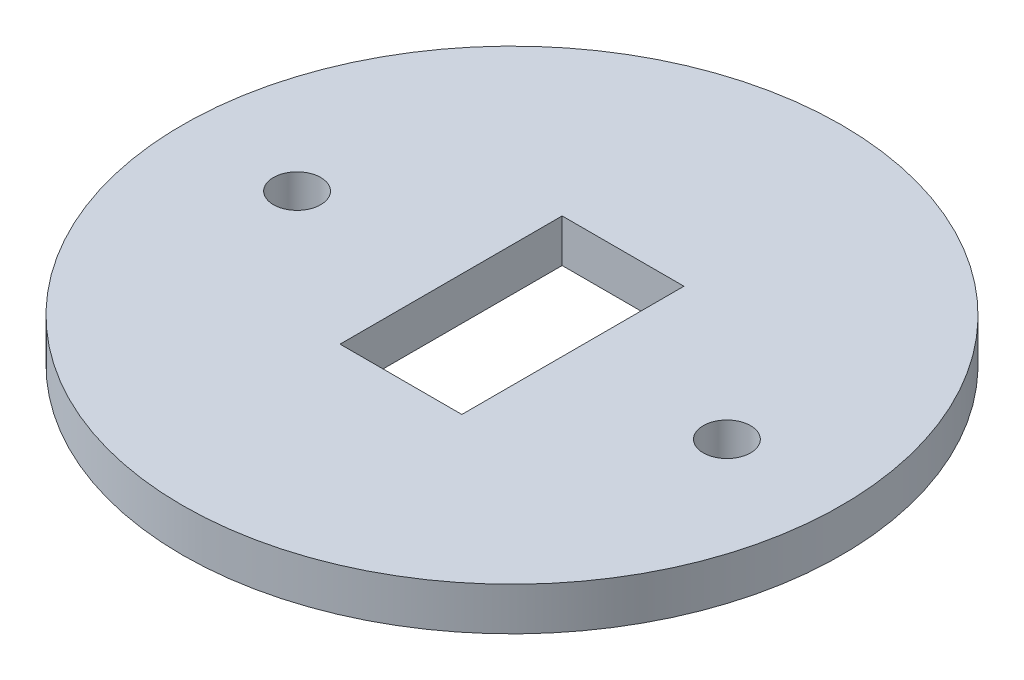
ISO-10303-21;
HEADER;
FILE_DESCRIPTION(('STEP AP214'),'2;1');
FILE_NAME('part.step','',(''),(''),'','','');
FILE_SCHEMA(('AUTOMOTIVE_DESIGN { 1 0 10303 214 1 1 1 1 }'));
ENDSEC;
DATA;
#1=APPLICATION_CONTEXT('core data for automotive mechanical design processes');
#2=APPLICATION_PROTOCOL_DEFINITION('international standard','automotive_design',2000,#1);
#3=PRODUCT_CONTEXT('',#1,'mechanical');
#4=PRODUCT('Part','Part','',(#3));
#5=PRODUCT_RELATED_PRODUCT_CATEGORY('part','',(#4));
#6=PRODUCT_DEFINITION_FORMATION('','',#4);
#7=PRODUCT_DEFINITION_CONTEXT('part definition',#1,'design');
#8=PRODUCT_DEFINITION('design','',#6,#7);
#9=PRODUCT_DEFINITION_SHAPE('','',#8);
#10=(LENGTH_UNIT() NAMED_UNIT(*) SI_UNIT(.MILLI.,.METRE.));
#11=(NAMED_UNIT(*) PLANE_ANGLE_UNIT() SI_UNIT($,.RADIAN.));
#12=(NAMED_UNIT(*) SI_UNIT($,.STERADIAN.) SOLID_ANGLE_UNIT());
#13=UNCERTAINTY_MEASURE_WITH_UNIT(LENGTH_MEASURE(1.E-05),#10,'distance_accuracy_value','');
#14=(GEOMETRIC_REPRESENTATION_CONTEXT(3) GLOBAL_UNCERTAINTY_ASSIGNED_CONTEXT((#13)) GLOBAL_UNIT_ASSIGNED_CONTEXT((#10,
#11,#12)) REPRESENTATION_CONTEXT('',''));
#15=CARTESIAN_POINT('',(0.,0.,0.));
#16=DIRECTION('',(0.,0.,1.));
#17=DIRECTION('',(1.,0.,0.));
#18=AXIS2_PLACEMENT_3D('',#15,#16,#17);
#19=CARTESIAN_POINT('',(0.,3.,0.));
#20=DIRECTION('',(0.,1.,0.));
#21=DIRECTION('',(0.,0.,1.));
#22=AXIS2_PLACEMENT_3D('',#19,#20,#21);
#23=PLANE('',#22);
#24=CARTESIAN_POINT('',(-15.,3.,0.));
#25=DIRECTION('',(0.,1.,0.));
#26=DIRECTION('',(0.,0.,1.));
#27=AXIS2_PLACEMENT_3D('',#24,#25,#26);
#28=CIRCLE('',#27,1.65);
#29=CARTESIAN_POINT('',(-15.,3.,1.65));
#30=VERTEX_POINT('',#29);
#31=EDGE_CURVE('E127',#30,#30,#28,.T.);
#32=ORIENTED_EDGE('',*,*,#31,.F.);
#33=EDGE_LOOP('',(#32));
#34=FACE_BOUND('',#33,.T.);
#35=CARTESIAN_POINT('',(0.,3.,0.));
#36=DIRECTION('',(0.,1.,0.));
#37=DIRECTION('',(0.,0.,1.));
#38=AXIS2_PLACEMENT_3D('',#35,#36,#37);
#39=CIRCLE('',#38,23.);
#40=CARTESIAN_POINT('',(0.,3.,23.));
#41=VERTEX_POINT('',#40);
#42=EDGE_CURVE('E11',#41,#41,#39,.T.);
#43=ORIENTED_EDGE('',*,*,#42,.T.);
#44=EDGE_LOOP('',(#43));
#45=FACE_BOUND('',#44,.T.);
#46=DIRECTION('',(1.,0.,0.));
#47=VECTOR('',#46,1.);
#48=CARTESIAN_POINT('',(4.25,3.,7.75));
#49=LINE('',#48,#47);
#50=CARTESIAN_POINT('',(-4.25,3.,7.75));
#51=VERTEX_POINT('',#50);
#52=CARTESIAN_POINT('',(4.25,3.,7.75));
#53=VERTEX_POINT('',#52);
#54=EDGE_CURVE('E102',#51,#53,#49,.T.);
#55=ORIENTED_EDGE('',*,*,#54,.F.);
#56=DIRECTION('',(0.,0.,1.));
#57=VECTOR('',#56,1.);
#58=CARTESIAN_POINT('',(-4.25,3.,7.75));
#59=LINE('',#58,#57);
#60=CARTESIAN_POINT('',(-4.25,3.,-7.75));
#61=VERTEX_POINT('',#60);
#62=EDGE_CURVE('E93',#61,#51,#59,.T.);
#63=ORIENTED_EDGE('',*,*,#62,.F.);
#64=DIRECTION('',(-1.,0.,0.));
#65=VECTOR('',#64,1.);
#66=CARTESIAN_POINT('',(4.25,3.,-7.75));
#67=LINE('',#66,#65);
#68=CARTESIAN_POINT('',(4.25,3.,-7.75));
#69=VERTEX_POINT('',#68);
#70=EDGE_CURVE('E119',#69,#61,#67,.T.);
#71=ORIENTED_EDGE('',*,*,#70,.F.);
#72=DIRECTION('',(0.,0.,-1.));
#73=VECTOR('',#72,1.);
#74=CARTESIAN_POINT('',(4.25,3.,7.75));
#75=LINE('',#74,#73);
#76=EDGE_CURVE('E115',#53,#69,#75,.T.);
#77=ORIENTED_EDGE('',*,*,#76,.F.);
#78=EDGE_LOOP('',(#55,#63,#71,#77));
#79=FACE_BOUND('',#78,.T.);
#80=CARTESIAN_POINT('',(15.,3.,0.));
#81=DIRECTION('',(0.,1.,0.));
#82=DIRECTION('',(0.,0.,1.));
#83=AXIS2_PLACEMENT_3D('',#80,#81,#82);
#84=CIRCLE('',#83,1.65);
#85=CARTESIAN_POINT('',(15.,3.,1.65));
#86=VERTEX_POINT('',#85);
#87=EDGE_CURVE('E256',#86,#86,#84,.T.);
#88=ORIENTED_EDGE('',*,*,#87,.F.);
#89=EDGE_LOOP('',(#88));
#90=FACE_BOUND('',#89,.T.);
#91=ADVANCED_FACE('F47',(#34,#45,#79,#90),#23,.T.);
#92=CARTESIAN_POINT('',(0.,0.,0.));
#93=DIRECTION('',(0.,1.,0.));
#94=DIRECTION('',(0.,0.,1.));
#95=AXIS2_PLACEMENT_3D('',#92,#93,#94);
#96=PLANE('',#95);
#97=CARTESIAN_POINT('',(0.,0.,0.));
#98=DIRECTION('',(0.,1.,0.));
#99=DIRECTION('',(0.,0.,1.));
#100=AXIS2_PLACEMENT_3D('',#97,#98,#99);
#101=CIRCLE('',#100,23.);
#102=CARTESIAN_POINT('',(0.,0.,23.));
#103=VERTEX_POINT('',#102);
#104=EDGE_CURVE('E51',#103,#103,#101,.T.);
#105=ORIENTED_EDGE('',*,*,#104,.F.);
#106=EDGE_LOOP('',(#105));
#107=FACE_BOUND('',#106,.T.);
#108=DIRECTION('',(0.,0.,1.));
#109=VECTOR('',#108,1.);
#110=CARTESIAN_POINT('',(-4.25,0.,7.75));
#111=LINE('',#110,#109);
#112=CARTESIAN_POINT('',(-4.25,0.,-7.75));
#113=VERTEX_POINT('',#112);
#114=CARTESIAN_POINT('',(-4.25,0.,7.75));
#115=VERTEX_POINT('',#114);
#116=EDGE_CURVE('E71',#113,#115,#111,.T.);
#117=ORIENTED_EDGE('',*,*,#116,.T.);
#118=DIRECTION('',(1.,0.,0.));
#119=VECTOR('',#118,1.);
#120=CARTESIAN_POINT('',(4.25,0.,7.75));
#121=LINE('',#120,#119);
#122=CARTESIAN_POINT('',(4.25,0.,7.75));
#123=VERTEX_POINT('',#122);
#124=EDGE_CURVE('E109',#115,#123,#121,.T.);
#125=ORIENTED_EDGE('',*,*,#124,.T.);
#126=DIRECTION('',(0.,0.,-1.));
#127=VECTOR('',#126,1.);
#128=CARTESIAN_POINT('',(4.25,0.,7.75));
#129=LINE('',#128,#127);
#130=CARTESIAN_POINT('',(4.25,0.,-7.75));
#131=VERTEX_POINT('',#130);
#132=EDGE_CURVE('E130',#123,#131,#129,.T.);
#133=ORIENTED_EDGE('',*,*,#132,.T.);
#134=DIRECTION('',(-1.,0.,0.));
#135=VECTOR('',#134,1.);
#136=CARTESIAN_POINT('',(4.25,0.,-7.75));
#137=LINE('',#136,#135);
#138=EDGE_CURVE('E103',#131,#113,#137,.T.);
#139=ORIENTED_EDGE('',*,*,#138,.T.);
#140=EDGE_LOOP('',(#117,#125,#133,#139));
#141=FACE_BOUND('',#140,.T.);
#142=CARTESIAN_POINT('',(-15.,0.,0.));
#143=DIRECTION('',(0.,1.,0.));
#144=DIRECTION('',(0.,0.,1.));
#145=AXIS2_PLACEMENT_3D('',#142,#143,#144);
#146=CIRCLE('',#145,1.65);
#147=CARTESIAN_POINT('',(-15.,0.,1.65));
#148=VERTEX_POINT('',#147);
#149=EDGE_CURVE('E264',#148,#148,#146,.T.);
#150=ORIENTED_EDGE('',*,*,#149,.T.);
#151=EDGE_LOOP('',(#150));
#152=FACE_BOUND('',#151,.T.);
#153=CARTESIAN_POINT('',(15.,0.,0.));
#154=DIRECTION('',(0.,1.,0.));
#155=DIRECTION('',(0.,0.,1.));
#156=AXIS2_PLACEMENT_3D('',#153,#154,#155);
#157=CIRCLE('',#156,1.65);
#158=CARTESIAN_POINT('',(15.,0.,1.65));
#159=VERTEX_POINT('',#158);
#160=EDGE_CURVE('E259',#159,#159,#157,.T.);
#161=ORIENTED_EDGE('',*,*,#160,.T.);
#162=EDGE_LOOP('',(#161));
#163=FACE_BOUND('',#162,.T.);
#164=ADVANCED_FACE('F146',(#107,#141,#152,#163),#96,.F.);
#165=CARTESIAN_POINT('',(0.,3.,0.));
#166=DIRECTION('',(0.,-1.,0.));
#167=DIRECTION('',(0.,0.,-1.));
#168=AXIS2_PLACEMENT_3D('',#165,#166,#167);
#169=CYLINDRICAL_SURFACE('',#168,23.);
#170=ORIENTED_EDGE('',*,*,#42,.F.);
#171=EDGE_LOOP('',(#170));
#172=FACE_BOUND('',#171,.T.);
#173=ORIENTED_EDGE('',*,*,#104,.T.);
#174=EDGE_LOOP('',(#173));
#175=FACE_BOUND('',#174,.T.);
#176=ADVANCED_FACE('F49',(#172,#175),#169,.T.);
#177=CARTESIAN_POINT('',(-4.25,3.,7.75));
#178=DIRECTION('',(1.,0.,0.));
#179=DIRECTION('',(0.,0.,-1.));
#180=AXIS2_PLACEMENT_3D('',#177,#178,#179);
#181=PLANE('',#180);
#182=ORIENTED_EDGE('',*,*,#116,.F.);
#183=DIRECTION('',(0.,-1.,0.));
#184=VECTOR('',#183,1.);
#185=CARTESIAN_POINT('',(-4.25,3.,-7.75));
#186=LINE('',#185,#184);
#187=EDGE_CURVE('E97',#61,#113,#186,.T.);
#188=ORIENTED_EDGE('',*,*,#187,.F.);
#189=ORIENTED_EDGE('',*,*,#62,.T.);
#190=DIRECTION('',(0.,-1.,0.));
#191=VECTOR('',#190,1.);
#192=CARTESIAN_POINT('',(-4.25,3.,7.75));
#193=LINE('',#192,#191);
#194=EDGE_CURVE('E96',#51,#115,#193,.T.);
#195=ORIENTED_EDGE('',*,*,#194,.T.);
#196=EDGE_LOOP('',(#182,#188,#189,#195));
#197=FACE_BOUND('',#196,.T.);
#198=ADVANCED_FACE('F95',(#197),#181,.T.);
#199=CARTESIAN_POINT('',(4.25,3.,7.75));
#200=DIRECTION('',(0.,0.,-1.));
#201=DIRECTION('',(-1.,0.,0.));
#202=AXIS2_PLACEMENT_3D('',#199,#200,#201);
#203=PLANE('',#202);
#204=ORIENTED_EDGE('',*,*,#124,.F.);
#205=ORIENTED_EDGE('',*,*,#194,.F.);
#206=ORIENTED_EDGE('',*,*,#54,.T.);
#207=DIRECTION('',(0.,-1.,0.));
#208=VECTOR('',#207,1.);
#209=CARTESIAN_POINT('',(4.25,3.,7.75));
#210=LINE('',#209,#208);
#211=EDGE_CURVE('E111',#53,#123,#210,.T.);
#212=ORIENTED_EDGE('',*,*,#211,.T.);
#213=EDGE_LOOP('',(#204,#205,#206,#212));
#214=FACE_BOUND('',#213,.T.);
#215=ADVANCED_FACE('F106',(#214),#203,.T.);
#216=CARTESIAN_POINT('',(4.25,3.,7.75));
#217=DIRECTION('',(-1.,0.,0.));
#218=DIRECTION('',(0.,0.,1.));
#219=AXIS2_PLACEMENT_3D('',#216,#217,#218);
#220=PLANE('',#219);
#221=ORIENTED_EDGE('',*,*,#132,.F.);
#222=ORIENTED_EDGE('',*,*,#211,.F.);
#223=ORIENTED_EDGE('',*,*,#76,.T.);
#224=DIRECTION('',(0.,-1.,0.));
#225=VECTOR('',#224,1.);
#226=CARTESIAN_POINT('',(4.25,3.,-7.75));
#227=LINE('',#226,#225);
#228=EDGE_CURVE('E63',#69,#131,#227,.T.);
#229=ORIENTED_EDGE('',*,*,#228,.T.);
#230=EDGE_LOOP('',(#221,#222,#223,#229));
#231=FACE_BOUND('',#230,.T.);
#232=ADVANCED_FACE('F144',(#231),#220,.T.);
#233=CARTESIAN_POINT('',(4.25,3.,-7.75));
#234=DIRECTION('',(0.,0.,1.));
#235=DIRECTION('',(1.,0.,0.));
#236=AXIS2_PLACEMENT_3D('',#233,#234,#235);
#237=PLANE('',#236);
#238=ORIENTED_EDGE('',*,*,#138,.F.);
#239=ORIENTED_EDGE('',*,*,#228,.F.);
#240=ORIENTED_EDGE('',*,*,#70,.T.);
#241=ORIENTED_EDGE('',*,*,#187,.T.);
#242=EDGE_LOOP('',(#238,#239,#240,#241));
#243=FACE_BOUND('',#242,.T.);
#244=ADVANCED_FACE('F148',(#243),#237,.T.);
#245=CARTESIAN_POINT('',(-15.,3.,0.));
#246=DIRECTION('',(0.,-1.,0.));
#247=DIRECTION('',(0.,0.,-1.));
#248=AXIS2_PLACEMENT_3D('',#245,#246,#247);
#249=CYLINDRICAL_SURFACE('',#248,1.65);
#250=ORIENTED_EDGE('',*,*,#31,.T.);
#251=EDGE_LOOP('',(#250));
#252=FACE_BOUND('',#251,.T.);
#253=ORIENTED_EDGE('',*,*,#149,.F.);
#254=EDGE_LOOP('',(#253));
#255=FACE_BOUND('',#254,.T.);
#256=ADVANCED_FACE('F150',(#252,#255),#249,.F.);
#257=CARTESIAN_POINT('',(15.,3.,0.));
#258=DIRECTION('',(0.,-1.,0.));
#259=DIRECTION('',(0.,0.,-1.));
#260=AXIS2_PLACEMENT_3D('',#257,#258,#259);
#261=CYLINDRICAL_SURFACE('',#260,1.65);
#262=ORIENTED_EDGE('',*,*,#87,.T.);
#263=EDGE_LOOP('',(#262));
#264=FACE_BOUND('',#263,.T.);
#265=ORIENTED_EDGE('',*,*,#160,.F.);
#266=EDGE_LOOP('',(#265));
#267=FACE_BOUND('',#266,.T.);
#268=ADVANCED_FACE('F156',(#264,#267),#261,.F.);
#269=CLOSED_SHELL('',(#91,#164,#176,#198,#215,#232,#244,#256,#268));
#270=MANIFOLD_SOLID_BREP('B2',#269);
#271=ADVANCED_BREP_SHAPE_REPRESENTATION('',(#18,#270),#14);
#272=SHAPE_DEFINITION_REPRESENTATION(#9,#271);
ENDSEC;
END-ISO-10303-21;
